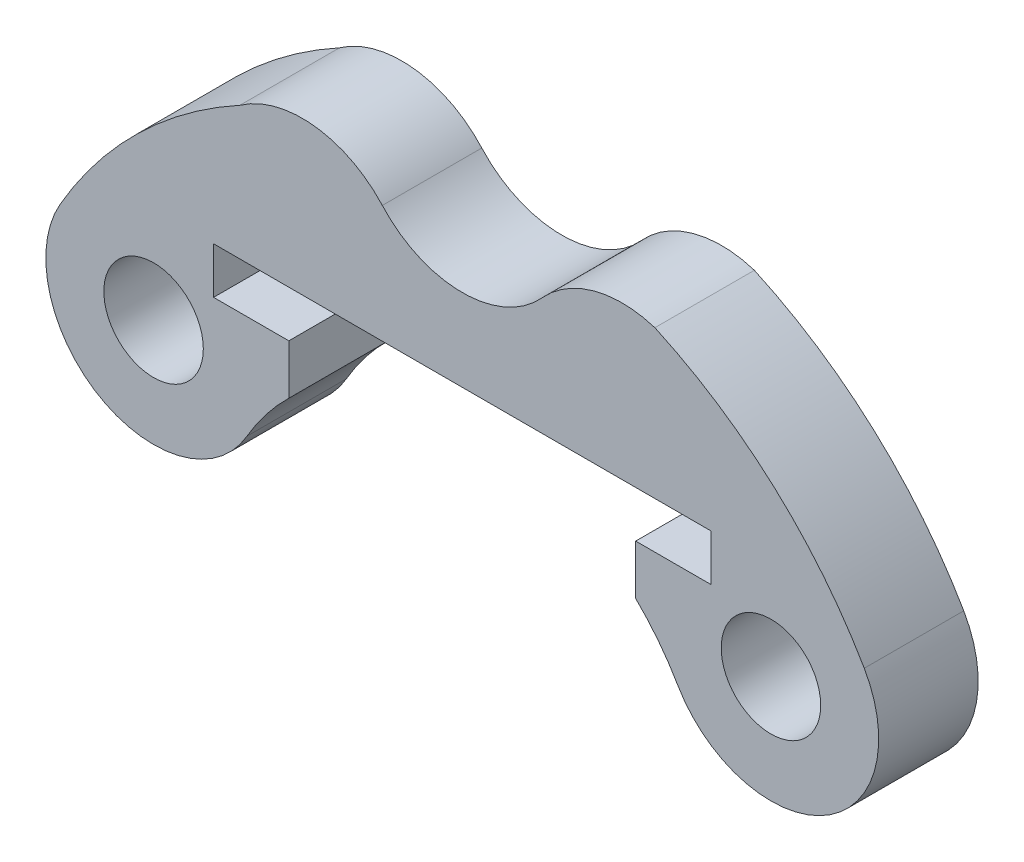
ISO-10303-21;
HEADER;
FILE_DESCRIPTION(('STEP AP214'),'2;1');
FILE_NAME('part.step','',(''),(''),'','','');
FILE_SCHEMA(('AUTOMOTIVE_DESIGN { 1 0 10303 214 1 1 1 1 }'));
ENDSEC;
DATA;
#1=APPLICATION_CONTEXT('core data for automotive mechanical design processes');
#2=APPLICATION_PROTOCOL_DEFINITION('international standard','automotive_design',2000,#1);
#3=PRODUCT_CONTEXT('',#1,'mechanical');
#4=PRODUCT('Part','Part','',(#3));
#5=PRODUCT_RELATED_PRODUCT_CATEGORY('part','',(#4));
#6=PRODUCT_DEFINITION_FORMATION('','',#4);
#7=PRODUCT_DEFINITION_CONTEXT('part definition',#1,'design');
#8=PRODUCT_DEFINITION('design','',#6,#7);
#9=PRODUCT_DEFINITION_SHAPE('','',#8);
#10=(LENGTH_UNIT() NAMED_UNIT(*) SI_UNIT(.MILLI.,.METRE.));
#11=(NAMED_UNIT(*) PLANE_ANGLE_UNIT() SI_UNIT($,.RADIAN.));
#12=(NAMED_UNIT(*) SI_UNIT($,.STERADIAN.) SOLID_ANGLE_UNIT());
#13=UNCERTAINTY_MEASURE_WITH_UNIT(LENGTH_MEASURE(1.E-05),#10,'distance_accuracy_value','');
#14=(GEOMETRIC_REPRESENTATION_CONTEXT(3) GLOBAL_UNCERTAINTY_ASSIGNED_CONTEXT((#13)) GLOBAL_UNIT_ASSIGNED_CONTEXT((#10,
#11,#12)) REPRESENTATION_CONTEXT('',''));
#15=CARTESIAN_POINT('',(0.,0.,0.));
#16=DIRECTION('',(0.,0.,1.));
#17=DIRECTION('',(1.,0.,0.));
#18=AXIS2_PLACEMENT_3D('',#15,#16,#17);
#19=CARTESIAN_POINT('',(-9.30977309068277,5.37499999999991,3.));
#20=DIRECTION('',(0.,0.,1.));
#21=DIRECTION('',(1.,0.,0.));
#22=AXIS2_PLACEMENT_3D('',#19,#20,#21);
#23=PLANE('',#22);
#24=CARTESIAN_POINT('',(9.30977309068406,5.37499999999767,3.));
#25=DIRECTION('',(0.,0.,1.));
#26=DIRECTION('',(1.,0.,0.));
#27=AXIS2_PLACEMENT_3D('',#24,#25,#26);
#28=CIRCLE('',#27,1.49999999999935);
#29=CARTESIAN_POINT('',(10.8097730906834,5.37499999999767,3.));
#30=VERTEX_POINT('',#29);
#31=EDGE_CURVE('E182',#30,#30,#28,.T.);
#32=ORIENTED_EDGE('',*,*,#31,.F.);
#33=EDGE_LOOP('',(#32));
#34=FACE_BOUND('',#33,.T.);
#35=CARTESIAN_POINT('',(-9.30977309068277,5.37499999999991,3.));
#36=DIRECTION('',(0.,0.,1.));
#37=DIRECTION('',(1.,0.,0.));
#38=AXIS2_PLACEMENT_3D('',#35,#36,#37);
#39=CIRCLE('',#38,3.25);
#40=CARTESIAN_POINT('',(-12.1243556529822,6.99999999999988,3.));
#41=VERTEX_POINT('',#40);
#42=CARTESIAN_POINT('',(-6.49519052838333,3.74999999999994,3.));
#43=VERTEX_POINT('',#42);
#44=EDGE_CURVE('E209',#41,#43,#39,.T.);
#45=ORIENTED_EDGE('',*,*,#44,.T.);
#46=CARTESIAN_POINT('',(0.,0.,3.));
#47=DIRECTION('',(0.,0.,-1.));
#48=DIRECTION('',(1.,0.,0.));
#49=AXIS2_PLACEMENT_3D('',#46,#47,#48);
#50=CIRCLE('',#49,7.5);
#51=CARTESIAN_POINT('',(-5.23061898822752,5.37499999999942,3.));
#52=VERTEX_POINT('',#51);
#53=EDGE_CURVE('E117',#43,#52,#50,.T.);
#54=ORIENTED_EDGE('',*,*,#53,.T.);
#55=DIRECTION('',(0.,1.,0.));
#56=VECTOR('',#55,1.);
#57=CARTESIAN_POINT('',(-5.23061898822752,5.37499999999942,3.));
#58=LINE('',#57,#56);
#59=CARTESIAN_POINT('',(-5.23061898822752,6.87499999999702,3.));
#60=VERTEX_POINT('',#59);
#61=EDGE_CURVE('E248',#52,#60,#58,.T.);
#62=ORIENTED_EDGE('',*,*,#61,.T.);
#63=DIRECTION('',(-1.,0.,0.));
#64=VECTOR('',#63,1.);
#65=CARTESIAN_POINT('',(-5.23061898822752,6.87499999999702,3.));
#66=LINE('',#65,#64);
#67=CARTESIAN_POINT('',(-7.49999999999935,6.87499999999702,3.));
#68=VERTEX_POINT('',#67);
#69=EDGE_CURVE('E267',#60,#68,#66,.T.);
#70=ORIENTED_EDGE('',*,*,#69,.T.);
#71=DIRECTION('',(0.,1.,0.));
#72=VECTOR('',#71,1.);
#73=CARTESIAN_POINT('',(-7.49999999999935,8.27499999999702,3.));
#74=LINE('',#73,#72);
#75=CARTESIAN_POINT('',(-7.49999999999935,8.27499999999702,3.));
#76=VERTEX_POINT('',#75);
#77=EDGE_CURVE('E264',#68,#76,#74,.T.);
#78=ORIENTED_EDGE('',*,*,#77,.T.);
#79=DIRECTION('',(1.,0.,0.));
#80=VECTOR('',#79,1.);
#81=CARTESIAN_POINT('',(7.50000000000065,8.27499999999702,3.));
#82=LINE('',#81,#80);
#83=CARTESIAN_POINT('',(7.50000000000065,8.27499999999702,3.));
#84=VERTEX_POINT('',#83);
#85=EDGE_CURVE('E266',#76,#84,#82,.T.);
#86=ORIENTED_EDGE('',*,*,#85,.T.);
#87=DIRECTION('',(0.,-1.,0.));
#88=VECTOR('',#87,1.);
#89=CARTESIAN_POINT('',(7.50000000000065,6.87499999999702,3.));
#90=LINE('',#89,#88);
#91=CARTESIAN_POINT('',(7.50000000000065,6.87499999999702,3.));
#92=VERTEX_POINT('',#91);
#93=EDGE_CURVE('E269',#84,#92,#90,.T.);
#94=ORIENTED_EDGE('',*,*,#93,.T.);
#95=DIRECTION('',(-1.,0.,0.));
#96=VECTOR('',#95,1.);
#97=CARTESIAN_POINT('',(5.23061898822881,6.87499999999702,3.));
#98=LINE('',#97,#96);
#99=CARTESIAN_POINT('',(5.23061898822881,6.87499999999702,3.));
#100=VERTEX_POINT('',#99);
#101=EDGE_CURVE('E275',#92,#100,#98,.T.);
#102=ORIENTED_EDGE('',*,*,#101,.T.);
#103=DIRECTION('',(0.,-1.,0.));
#104=VECTOR('',#103,1.);
#105=CARTESIAN_POINT('',(5.23061898822881,5.37499999999816,3.));
#106=LINE('',#105,#104);
#107=CARTESIAN_POINT('',(5.23061898822881,5.37499999999816,3.));
#108=VERTEX_POINT('',#107);
#109=EDGE_CURVE('E277',#100,#108,#106,.T.);
#110=ORIENTED_EDGE('',*,*,#109,.T.);
#111=CARTESIAN_POINT('',(0.,0.,3.));
#112=DIRECTION('',(0.,0.,-1.));
#113=DIRECTION('',(1.,0.,0.));
#114=AXIS2_PLACEMENT_3D('',#111,#112,#113);
#115=CIRCLE('',#114,7.5);
#116=CARTESIAN_POINT('',(6.49519052838322,3.75000000000012,3.));
#117=VERTEX_POINT('',#116);
#118=EDGE_CURVE('E279',#108,#117,#115,.T.);
#119=ORIENTED_EDGE('',*,*,#118,.T.);
#120=CARTESIAN_POINT('',(9.30977309068406,5.37499999999767,3.));
#121=DIRECTION('',(0.,0.,1.));
#122=DIRECTION('',(1.,0.,0.));
#123=AXIS2_PLACEMENT_3D('',#120,#121,#122);
#124=CIRCLE('',#123,3.25);
#125=CARTESIAN_POINT('',(12.1243556529839,6.99999999999697,3.));
#126=VERTEX_POINT('',#125);
#127=EDGE_CURVE('E281',#117,#126,#124,.T.);
#128=ORIENTED_EDGE('',*,*,#127,.T.);
#129=CARTESIAN_POINT('',(0.,0.,3.));
#130=DIRECTION('',(0.,0.,1.));
#131=DIRECTION('',(1.,0.,0.));
#132=AXIS2_PLACEMENT_3D('',#129,#130,#131);
#133=CIRCLE('',#132,14.);
#134=CARTESIAN_POINT('',(5.80943087987062,12.7377593340432,3.));
#135=VERTEX_POINT('',#134);
#136=EDGE_CURVE('E283',#126,#135,#133,.T.);
#137=ORIENTED_EDGE('',*,*,#136,.T.);
#138=CARTESIAN_POINT('',(4.82206978136234,9.64137142857136,3.));
#139=DIRECTION('',(0.,0.,1.));
#140=DIRECTION('',(1.,0.,0.));
#141=AXIS2_PLACEMENT_3D('',#138,#139,#140);
#142=CIRCLE('',#141,3.25);
#143=CARTESIAN_POINT('',(2.41103489067909,11.8206857142833,3.));
#144=VERTEX_POINT('',#143);
#145=EDGE_CURVE('E160',#135,#144,#142,.T.);
#146=ORIENTED_EDGE('',*,*,#145,.T.);
#147=CARTESIAN_POINT('',(1.07437023516552E-11,13.9999999999817,3.));
#148=DIRECTION('',(0.,0.,-1.));
#149=DIRECTION('',(1.,0.,0.));
#150=AXIS2_PLACEMENT_3D('',#147,#148,#149);
#151=CIRCLE('',#150,3.24999999997992);
#152=CARTESIAN_POINT('',(-2.41103489066096,11.820685714287,3.));
#153=VERTEX_POINT('',#152);
#154=EDGE_CURVE('E154',#144,#153,#151,.T.);
#155=ORIENTED_EDGE('',*,*,#154,.T.);
#156=CARTESIAN_POINT('',(-4.82206978134755,9.64137142857876,3.));
#157=DIRECTION('',(0.,0.,1.));
#158=DIRECTION('',(1.,0.,0.));
#159=AXIS2_PLACEMENT_3D('',#156,#157,#158);
#160=CIRCLE('',#159,3.25);
#161=CARTESIAN_POINT('',(-6.70737151186402,12.2886601141799,3.));
#162=VERTEX_POINT('',#161);
#163=EDGE_CURVE('E158',#153,#162,#160,.T.);
#164=ORIENTED_EDGE('',*,*,#163,.T.);
#165=CARTESIAN_POINT('',(0.,0.,3.));
#166=DIRECTION('',(0.,0.,1.));
#167=DIRECTION('',(1.,0.,0.));
#168=AXIS2_PLACEMENT_3D('',#165,#166,#167);
#169=CIRCLE('',#168,14.);
#170=EDGE_CURVE('E50',#162,#41,#169,.T.);
#171=ORIENTED_EDGE('',*,*,#170,.T.);
#172=EDGE_LOOP('',(#45,#54,#62,#70,#78,#86,#94,#102,#110,#119,#128,#137,#146,#155,#164,#171));
#173=FACE_BOUND('',#172,.T.);
#174=CARTESIAN_POINT('',(-9.30977309068277,5.37499999999991,3.));
#175=DIRECTION('',(0.,0.,1.));
#176=DIRECTION('',(1.,0.,0.));
#177=AXIS2_PLACEMENT_3D('',#174,#175,#176);
#178=CIRCLE('',#177,1.5);
#179=CARTESIAN_POINT('',(-7.80977309068277,5.37499999999991,3.));
#180=VERTEX_POINT('',#179);
#181=EDGE_CURVE('E325',#180,#180,#178,.T.);
#182=ORIENTED_EDGE('',*,*,#181,.F.);
#183=EDGE_LOOP('',(#182));
#184=FACE_BOUND('',#183,.T.);
#185=ADVANCED_FACE('F33',(#34,#173,#184),#23,.T.);
#186=CARTESIAN_POINT('',(-9.30977309068277,5.37499999999991,0.));
#187=DIRECTION('',(0.,0.,1.));
#188=DIRECTION('',(1.,0.,0.));
#189=AXIS2_PLACEMENT_3D('',#186,#187,#188);
#190=PLANE('',#189);
#191=CARTESIAN_POINT('',(-9.30977309068277,5.37499999999991,0.));
#192=DIRECTION('',(0.,0.,1.));
#193=DIRECTION('',(1.,0.,0.));
#194=AXIS2_PLACEMENT_3D('',#191,#192,#193);
#195=CIRCLE('',#194,3.25);
#196=CARTESIAN_POINT('',(-12.1243556529822,6.99999999999988,0.));
#197=VERTEX_POINT('',#196);
#198=CARTESIAN_POINT('',(-6.49519052838333,3.74999999999994,0.));
#199=VERTEX_POINT('',#198);
#200=EDGE_CURVE('E178',#197,#199,#195,.T.);
#201=ORIENTED_EDGE('',*,*,#200,.F.);
#202=CARTESIAN_POINT('',(0.,0.,0.));
#203=DIRECTION('',(0.,0.,1.));
#204=DIRECTION('',(1.,0.,0.));
#205=AXIS2_PLACEMENT_3D('',#202,#203,#204);
#206=CIRCLE('',#205,14.);
#207=CARTESIAN_POINT('',(-6.70737151186402,12.2886601141799,0.));
#208=VERTEX_POINT('',#207);
#209=EDGE_CURVE('E109',#208,#197,#206,.T.);
#210=ORIENTED_EDGE('',*,*,#209,.F.);
#211=CARTESIAN_POINT('',(-4.82206978134755,9.64137142857876,0.));
#212=DIRECTION('',(0.,0.,1.));
#213=DIRECTION('',(1.,0.,0.));
#214=AXIS2_PLACEMENT_3D('',#211,#212,#213);
#215=CIRCLE('',#214,3.25);
#216=CARTESIAN_POINT('',(-2.41103489066096,11.820685714287,0.));
#217=VERTEX_POINT('',#216);
#218=EDGE_CURVE('E103',#217,#208,#215,.T.);
#219=ORIENTED_EDGE('',*,*,#218,.F.);
#220=CARTESIAN_POINT('',(1.07437023516552E-11,13.9999999999817,0.));
#221=DIRECTION('',(0.,0.,-1.));
#222=DIRECTION('',(1.,0.,0.));
#223=AXIS2_PLACEMENT_3D('',#220,#221,#222);
#224=CIRCLE('',#223,3.24999999997992);
#225=CARTESIAN_POINT('',(2.41103489067909,11.8206857142833,0.));
#226=VERTEX_POINT('',#225);
#227=EDGE_CURVE('E168',#226,#217,#224,.T.);
#228=ORIENTED_EDGE('',*,*,#227,.F.);
#229=CARTESIAN_POINT('',(4.82206978136234,9.64137142857136,0.));
#230=DIRECTION('',(0.,0.,1.));
#231=DIRECTION('',(1.,0.,0.));
#232=AXIS2_PLACEMENT_3D('',#229,#230,#231);
#233=CIRCLE('',#232,3.25);
#234=CARTESIAN_POINT('',(5.80943087987062,12.7377593340432,0.));
#235=VERTEX_POINT('',#234);
#236=EDGE_CURVE('E204',#235,#226,#233,.T.);
#237=ORIENTED_EDGE('',*,*,#236,.F.);
#238=CARTESIAN_POINT('',(0.,0.,0.));
#239=DIRECTION('',(0.,0.,1.));
#240=DIRECTION('',(1.,0.,0.));
#241=AXIS2_PLACEMENT_3D('',#238,#239,#240);
#242=CIRCLE('',#241,14.);
#243=CARTESIAN_POINT('',(12.1243556529839,6.99999999999697,0.));
#244=VERTEX_POINT('',#243);
#245=EDGE_CURVE('E202',#244,#235,#242,.T.);
#246=ORIENTED_EDGE('',*,*,#245,.F.);
#247=CARTESIAN_POINT('',(9.30977309068406,5.37499999999767,0.));
#248=DIRECTION('',(0.,0.,1.));
#249=DIRECTION('',(1.,0.,0.));
#250=AXIS2_PLACEMENT_3D('',#247,#248,#249);
#251=CIRCLE('',#250,3.25);
#252=CARTESIAN_POINT('',(6.49519052838322,3.75000000000012,0.));
#253=VERTEX_POINT('',#252);
#254=EDGE_CURVE('E200',#253,#244,#251,.T.);
#255=ORIENTED_EDGE('',*,*,#254,.F.);
#256=CARTESIAN_POINT('',(0.,0.,0.));
#257=DIRECTION('',(0.,0.,-1.));
#258=DIRECTION('',(1.,0.,0.));
#259=AXIS2_PLACEMENT_3D('',#256,#257,#258);
#260=CIRCLE('',#259,7.5);
#261=CARTESIAN_POINT('',(5.23061898822881,5.37499999999816,0.));
#262=VERTEX_POINT('',#261);
#263=EDGE_CURVE('E198',#262,#253,#260,.T.);
#264=ORIENTED_EDGE('',*,*,#263,.F.);
#265=DIRECTION('',(0.,-1.,0.));
#266=VECTOR('',#265,1.);
#267=CARTESIAN_POINT('',(5.23061898822881,5.37499999999816,0.));
#268=LINE('',#267,#266);
#269=CARTESIAN_POINT('',(5.23061898822881,6.87499999999702,0.));
#270=VERTEX_POINT('',#269);
#271=EDGE_CURVE('E196',#270,#262,#268,.T.);
#272=ORIENTED_EDGE('',*,*,#271,.F.);
#273=DIRECTION('',(-1.,0.,0.));
#274=VECTOR('',#273,1.);
#275=CARTESIAN_POINT('',(5.23061898822881,6.87499999999702,0.));
#276=LINE('',#275,#274);
#277=CARTESIAN_POINT('',(7.50000000000065,6.87499999999702,0.));
#278=VERTEX_POINT('',#277);
#279=EDGE_CURVE('E194',#278,#270,#276,.T.);
#280=ORIENTED_EDGE('',*,*,#279,.F.);
#281=DIRECTION('',(0.,-1.,0.));
#282=VECTOR('',#281,1.);
#283=CARTESIAN_POINT('',(7.50000000000065,6.87499999999702,0.));
#284=LINE('',#283,#282);
#285=CARTESIAN_POINT('',(7.50000000000065,8.27499999999702,0.));
#286=VERTEX_POINT('',#285);
#287=EDGE_CURVE('E192',#286,#278,#284,.T.);
#288=ORIENTED_EDGE('',*,*,#287,.F.);
#289=DIRECTION('',(1.,0.,0.));
#290=VECTOR('',#289,1.);
#291=CARTESIAN_POINT('',(7.50000000000065,8.27499999999702,0.));
#292=LINE('',#291,#290);
#293=CARTESIAN_POINT('',(-7.49999999999935,8.27499999999702,0.));
#294=VERTEX_POINT('',#293);
#295=EDGE_CURVE('E190',#294,#286,#292,.T.);
#296=ORIENTED_EDGE('',*,*,#295,.F.);
#297=DIRECTION('',(0.,1.,0.));
#298=VECTOR('',#297,1.);
#299=CARTESIAN_POINT('',(-7.49999999999935,8.27499999999702,0.));
#300=LINE('',#299,#298);
#301=CARTESIAN_POINT('',(-7.49999999999935,6.87499999999702,0.));
#302=VERTEX_POINT('',#301);
#303=EDGE_CURVE('E188',#302,#294,#300,.T.);
#304=ORIENTED_EDGE('',*,*,#303,.F.);
#305=DIRECTION('',(-1.,0.,0.));
#306=VECTOR('',#305,1.);
#307=CARTESIAN_POINT('',(-5.23061898822752,6.87499999999702,0.));
#308=LINE('',#307,#306);
#309=CARTESIAN_POINT('',(-5.23061898822752,6.87499999999702,0.));
#310=VERTEX_POINT('',#309);
#311=EDGE_CURVE('E186',#310,#302,#308,.T.);
#312=ORIENTED_EDGE('',*,*,#311,.F.);
#313=DIRECTION('',(0.,1.,0.));
#314=VECTOR('',#313,1.);
#315=CARTESIAN_POINT('',(-5.23061898822752,5.37499999999942,0.));
#316=LINE('',#315,#314);
#317=CARTESIAN_POINT('',(-5.23061898822752,5.37499999999942,0.));
#318=VERTEX_POINT('',#317);
#319=EDGE_CURVE('E184',#318,#310,#316,.T.);
#320=ORIENTED_EDGE('',*,*,#319,.F.);
#321=CARTESIAN_POINT('',(0.,0.,0.));
#322=DIRECTION('',(0.,0.,-1.));
#323=DIRECTION('',(1.,0.,0.));
#324=AXIS2_PLACEMENT_3D('',#321,#322,#323);
#325=CIRCLE('',#324,7.5);
#326=EDGE_CURVE('E181',#199,#318,#325,.T.);
#327=ORIENTED_EDGE('',*,*,#326,.F.);
#328=EDGE_LOOP('',(#201,#210,#219,#228,#237,#246,#255,#264,#272,#280,#288,#296,#304,#312,#320,#327));
#329=FACE_BOUND('',#328,.T.);
#330=CARTESIAN_POINT('',(9.30977309068406,5.37499999999767,0.));
#331=DIRECTION('',(0.,0.,1.));
#332=DIRECTION('',(1.,0.,0.));
#333=AXIS2_PLACEMENT_3D('',#330,#331,#332);
#334=CIRCLE('',#333,1.49999999999935);
#335=CARTESIAN_POINT('',(10.8097730906834,5.37499999999767,0.));
#336=VERTEX_POINT('',#335);
#337=EDGE_CURVE('E331',#336,#336,#334,.T.);
#338=ORIENTED_EDGE('',*,*,#337,.T.);
#339=EDGE_LOOP('',(#338));
#340=FACE_BOUND('',#339,.T.);
#341=CARTESIAN_POINT('',(-9.30977309068277,5.37499999999991,0.));
#342=DIRECTION('',(0.,0.,1.));
#343=DIRECTION('',(1.,0.,0.));
#344=AXIS2_PLACEMENT_3D('',#341,#342,#343);
#345=CIRCLE('',#344,1.5);
#346=CARTESIAN_POINT('',(-7.80977309068277,5.37499999999991,0.));
#347=VERTEX_POINT('',#346);
#348=EDGE_CURVE('E328',#347,#347,#345,.T.);
#349=ORIENTED_EDGE('',*,*,#348,.T.);
#350=EDGE_LOOP('',(#349));
#351=FACE_BOUND('',#350,.T.);
#352=ADVANCED_FACE('F252',(#329,#340,#351),#190,.F.);
#353=CARTESIAN_POINT('',(-9.30977309068277,5.37499999999991,3.));
#354=DIRECTION('',(0.,0.,-1.));
#355=DIRECTION('',(-1.,0.,0.));
#356=AXIS2_PLACEMENT_3D('',#353,#354,#355);
#357=CYLINDRICAL_SURFACE('',#356,3.25);
#358=ORIENTED_EDGE('',*,*,#200,.T.);
#359=DIRECTION('',(0.,0.,-1.));
#360=VECTOR('',#359,1.);
#361=CARTESIAN_POINT('',(-6.49519052838333,3.74999999999994,3.));
#362=LINE('',#361,#360);
#363=EDGE_CURVE('E11',#43,#199,#362,.T.);
#364=ORIENTED_EDGE('',*,*,#363,.F.);
#365=ORIENTED_EDGE('',*,*,#44,.F.);
#366=DIRECTION('',(0.,0.,-1.));
#367=VECTOR('',#366,1.);
#368=CARTESIAN_POINT('',(-12.1243556529822,6.99999999999988,3.));
#369=LINE('',#368,#367);
#370=EDGE_CURVE('E174',#41,#197,#369,.T.);
#371=ORIENTED_EDGE('',*,*,#370,.T.);
#372=EDGE_LOOP('',(#358,#364,#365,#371));
#373=FACE_BOUND('',#372,.T.);
#374=ADVANCED_FACE('F35',(#373),#357,.T.);
#375=CARTESIAN_POINT('',(0.,0.,3.));
#376=DIRECTION('',(0.,0.,-1.));
#377=DIRECTION('',(-1.,0.,0.));
#378=AXIS2_PLACEMENT_3D('',#375,#376,#377);
#379=CYLINDRICAL_SURFACE('',#378,7.5);
#380=ORIENTED_EDGE('',*,*,#326,.T.);
#381=DIRECTION('',(0.,0.,-1.));
#382=VECTOR('',#381,1.);
#383=CARTESIAN_POINT('',(-5.23061898822752,5.37499999999942,3.));
#384=LINE('',#383,#382);
#385=EDGE_CURVE('E42',#52,#318,#384,.T.);
#386=ORIENTED_EDGE('',*,*,#385,.F.);
#387=ORIENTED_EDGE('',*,*,#53,.F.);
#388=ORIENTED_EDGE('',*,*,#363,.T.);
#389=EDGE_LOOP('',(#380,#386,#387,#388));
#390=FACE_BOUND('',#389,.T.);
#391=ADVANCED_FACE('F464',(#390),#379,.F.);
#392=CARTESIAN_POINT('',(-5.23061898822752,5.37499999999942,3.));
#393=DIRECTION('',(-1.,0.,0.));
#394=DIRECTION('',(0.,-1.,0.));
#395=AXIS2_PLACEMENT_3D('',#392,#393,#394);
#396=PLANE('',#395);
#397=ORIENTED_EDGE('',*,*,#319,.T.);
#398=DIRECTION('',(0.,0.,-1.));
#399=VECTOR('',#398,1.);
#400=CARTESIAN_POINT('',(-5.23061898822752,6.87499999999702,3.));
#401=LINE('',#400,#399);
#402=EDGE_CURVE('E240',#60,#310,#401,.T.);
#403=ORIENTED_EDGE('',*,*,#402,.F.);
#404=ORIENTED_EDGE('',*,*,#61,.F.);
#405=ORIENTED_EDGE('',*,*,#385,.T.);
#406=EDGE_LOOP('',(#397,#403,#404,#405));
#407=FACE_BOUND('',#406,.T.);
#408=ADVANCED_FACE('F246',(#407),#396,.F.);
#409=CARTESIAN_POINT('',(-5.23061898822752,6.87499999999702,3.));
#410=DIRECTION('',(0.,-1.,0.));
#411=DIRECTION('',(1.,0.,0.));
#412=AXIS2_PLACEMENT_3D('',#409,#410,#411);
#413=PLANE('',#412);
#414=ORIENTED_EDGE('',*,*,#311,.T.);
#415=DIRECTION('',(0.,0.,-1.));
#416=VECTOR('',#415,1.);
#417=CARTESIAN_POINT('',(-7.49999999999935,6.87499999999702,3.));
#418=LINE('',#417,#416);
#419=EDGE_CURVE('E237',#68,#302,#418,.T.);
#420=ORIENTED_EDGE('',*,*,#419,.F.);
#421=ORIENTED_EDGE('',*,*,#69,.F.);
#422=ORIENTED_EDGE('',*,*,#402,.T.);
#423=EDGE_LOOP('',(#414,#420,#421,#422));
#424=FACE_BOUND('',#423,.T.);
#425=ADVANCED_FACE('F258',(#424),#413,.F.);
#426=CARTESIAN_POINT('',(-7.49999999999935,8.27499999999702,3.));
#427=DIRECTION('',(-1.,0.,0.));
#428=DIRECTION('',(0.,0.,1.));
#429=AXIS2_PLACEMENT_3D('',#426,#427,#428);
#430=PLANE('',#429);
#431=ORIENTED_EDGE('',*,*,#303,.T.);
#432=DIRECTION('',(0.,0.,-1.));
#433=VECTOR('',#432,1.);
#434=CARTESIAN_POINT('',(-7.49999999999935,8.27499999999702,3.));
#435=LINE('',#434,#433);
#436=EDGE_CURVE('E234',#76,#294,#435,.T.);
#437=ORIENTED_EDGE('',*,*,#436,.F.);
#438=ORIENTED_EDGE('',*,*,#77,.F.);
#439=ORIENTED_EDGE('',*,*,#419,.T.);
#440=EDGE_LOOP('',(#431,#437,#438,#439));
#441=FACE_BOUND('',#440,.T.);
#442=ADVANCED_FACE('F262',(#441),#430,.F.);
#443=CARTESIAN_POINT('',(7.50000000000065,8.27499999999702,3.));
#444=DIRECTION('',(0.,1.,0.));
#445=DIRECTION('',(-1.,0.,0.));
#446=AXIS2_PLACEMENT_3D('',#443,#444,#445);
#447=PLANE('',#446);
#448=ORIENTED_EDGE('',*,*,#295,.T.);
#449=DIRECTION('',(0.,0.,-1.));
#450=VECTOR('',#449,1.);
#451=CARTESIAN_POINT('',(7.50000000000065,8.27499999999702,3.));
#452=LINE('',#451,#450);
#453=EDGE_CURVE('E231',#84,#286,#452,.T.);
#454=ORIENTED_EDGE('',*,*,#453,.F.);
#455=ORIENTED_EDGE('',*,*,#85,.F.);
#456=ORIENTED_EDGE('',*,*,#436,.T.);
#457=EDGE_LOOP('',(#448,#454,#455,#456));
#458=FACE_BOUND('',#457,.T.);
#459=ADVANCED_FACE('F429',(#458),#447,.F.);
#460=CARTESIAN_POINT('',(7.50000000000065,6.87499999999702,3.));
#461=DIRECTION('',(1.,0.,0.));
#462=DIRECTION('',(0.,0.,-1.));
#463=AXIS2_PLACEMENT_3D('',#460,#461,#462);
#464=PLANE('',#463);
#465=ORIENTED_EDGE('',*,*,#287,.T.);
#466=DIRECTION('',(0.,0.,-1.));
#467=VECTOR('',#466,1.);
#468=CARTESIAN_POINT('',(7.50000000000065,6.87499999999702,3.));
#469=LINE('',#468,#467);
#470=EDGE_CURVE('E228',#92,#278,#469,.T.);
#471=ORIENTED_EDGE('',*,*,#470,.F.);
#472=ORIENTED_EDGE('',*,*,#93,.F.);
#473=ORIENTED_EDGE('',*,*,#453,.T.);
#474=EDGE_LOOP('',(#465,#471,#472,#473));
#475=FACE_BOUND('',#474,.T.);
#476=ADVANCED_FACE('F419',(#475),#464,.F.);
#477=CARTESIAN_POINT('',(5.23061898822881,6.87499999999702,3.));
#478=DIRECTION('',(0.,-1.,0.));
#479=DIRECTION('',(1.,0.,0.));
#480=AXIS2_PLACEMENT_3D('',#477,#478,#479);
#481=PLANE('',#480);
#482=ORIENTED_EDGE('',*,*,#279,.T.);
#483=DIRECTION('',(0.,0.,-1.));
#484=VECTOR('',#483,1.);
#485=CARTESIAN_POINT('',(5.23061898822881,6.87499999999702,3.));
#486=LINE('',#485,#484);
#487=EDGE_CURVE('E225',#100,#270,#486,.T.);
#488=ORIENTED_EDGE('',*,*,#487,.F.);
#489=ORIENTED_EDGE('',*,*,#101,.F.);
#490=ORIENTED_EDGE('',*,*,#470,.T.);
#491=EDGE_LOOP('',(#482,#488,#489,#490));
#492=FACE_BOUND('',#491,.T.);
#493=ADVANCED_FACE('F409',(#492),#481,.F.);
#494=CARTESIAN_POINT('',(5.23061898822881,5.37499999999816,3.));
#495=DIRECTION('',(1.,0.,0.));
#496=DIRECTION('',(0.,1.,0.));
#497=AXIS2_PLACEMENT_3D('',#494,#495,#496);
#498=PLANE('',#497);
#499=ORIENTED_EDGE('',*,*,#271,.T.);
#500=DIRECTION('',(0.,0.,-1.));
#501=VECTOR('',#500,1.);
#502=CARTESIAN_POINT('',(5.23061898822881,5.37499999999816,3.));
#503=LINE('',#502,#501);
#504=EDGE_CURVE('E222',#108,#262,#503,.T.);
#505=ORIENTED_EDGE('',*,*,#504,.F.);
#506=ORIENTED_EDGE('',*,*,#109,.F.);
#507=ORIENTED_EDGE('',*,*,#487,.T.);
#508=EDGE_LOOP('',(#499,#505,#506,#507));
#509=FACE_BOUND('',#508,.T.);
#510=ADVANCED_FACE('F399',(#509),#498,.F.);
#511=CARTESIAN_POINT('',(0.,0.,3.));
#512=DIRECTION('',(0.,0.,-1.));
#513=DIRECTION('',(-1.,0.,0.));
#514=AXIS2_PLACEMENT_3D('',#511,#512,#513);
#515=CYLINDRICAL_SURFACE('',#514,7.5);
#516=ORIENTED_EDGE('',*,*,#263,.T.);
#517=DIRECTION('',(0.,0.,-1.));
#518=VECTOR('',#517,1.);
#519=CARTESIAN_POINT('',(6.49519052838322,3.75000000000012,3.));
#520=LINE('',#519,#518);
#521=EDGE_CURVE('E219',#117,#253,#520,.T.);
#522=ORIENTED_EDGE('',*,*,#521,.F.);
#523=ORIENTED_EDGE('',*,*,#118,.F.);
#524=ORIENTED_EDGE('',*,*,#504,.T.);
#525=EDGE_LOOP('',(#516,#522,#523,#524));
#526=FACE_BOUND('',#525,.T.);
#527=ADVANCED_FACE('F389',(#526),#515,.F.);
#528=CARTESIAN_POINT('',(9.30977309068406,5.37499999999767,3.));
#529=DIRECTION('',(0.,0.,-1.));
#530=DIRECTION('',(-1.,0.,0.));
#531=AXIS2_PLACEMENT_3D('',#528,#529,#530);
#532=CYLINDRICAL_SURFACE('',#531,3.25);
#533=ORIENTED_EDGE('',*,*,#254,.T.);
#534=DIRECTION('',(0.,0.,-1.));
#535=VECTOR('',#534,1.);
#536=CARTESIAN_POINT('',(12.1243556529839,6.99999999999697,3.));
#537=LINE('',#536,#535);
#538=EDGE_CURVE('E216',#126,#244,#537,.T.);
#539=ORIENTED_EDGE('',*,*,#538,.F.);
#540=ORIENTED_EDGE('',*,*,#127,.F.);
#541=ORIENTED_EDGE('',*,*,#521,.T.);
#542=EDGE_LOOP('',(#533,#539,#540,#541));
#543=FACE_BOUND('',#542,.T.);
#544=ADVANCED_FACE('F380',(#543),#532,.T.);
#545=CARTESIAN_POINT('',(0.,0.,3.));
#546=DIRECTION('',(0.,0.,-1.));
#547=DIRECTION('',(-1.,0.,0.));
#548=AXIS2_PLACEMENT_3D('',#545,#546,#547);
#549=CYLINDRICAL_SURFACE('',#548,14.);
#550=ORIENTED_EDGE('',*,*,#245,.T.);
#551=DIRECTION('',(0.,0.,-1.));
#552=VECTOR('',#551,1.);
#553=CARTESIAN_POINT('',(5.80943087987062,12.7377593340432,3.));
#554=LINE('',#553,#552);
#555=EDGE_CURVE('E213',#135,#235,#554,.T.);
#556=ORIENTED_EDGE('',*,*,#555,.F.);
#557=ORIENTED_EDGE('',*,*,#136,.F.);
#558=ORIENTED_EDGE('',*,*,#538,.T.);
#559=EDGE_LOOP('',(#550,#556,#557,#558));
#560=FACE_BOUND('',#559,.T.);
#561=ADVANCED_FACE('F289',(#560),#549,.T.);
#562=CARTESIAN_POINT('',(4.82206978136234,9.64137142857136,3.));
#563=DIRECTION('',(0.,0.,-1.));
#564=DIRECTION('',(-1.,0.,0.));
#565=AXIS2_PLACEMENT_3D('',#562,#563,#564);
#566=CYLINDRICAL_SURFACE('',#565,3.25);
#567=ORIENTED_EDGE('',*,*,#236,.T.);
#568=DIRECTION('',(0.,0.,-1.));
#569=VECTOR('',#568,1.);
#570=CARTESIAN_POINT('',(2.41103489067909,11.8206857142833,3.));
#571=LINE('',#570,#569);
#572=EDGE_CURVE('E169',#144,#226,#571,.T.);
#573=ORIENTED_EDGE('',*,*,#572,.F.);
#574=ORIENTED_EDGE('',*,*,#145,.F.);
#575=ORIENTED_EDGE('',*,*,#555,.T.);
#576=EDGE_LOOP('',(#567,#573,#574,#575));
#577=FACE_BOUND('',#576,.T.);
#578=ADVANCED_FACE('F293',(#577),#566,.T.);
#579=CARTESIAN_POINT('',(1.07437023516552E-11,13.9999999999817,3.));
#580=DIRECTION('',(0.,0.,-1.));
#581=DIRECTION('',(-1.,0.,0.));
#582=AXIS2_PLACEMENT_3D('',#579,#580,#581);
#583=CYLINDRICAL_SURFACE('',#582,3.24999999997992);
#584=ORIENTED_EDGE('',*,*,#227,.T.);
#585=DIRECTION('',(0.,0.,-1.));
#586=VECTOR('',#585,1.);
#587=CARTESIAN_POINT('',(-2.41103489066096,11.820685714287,3.));
#588=LINE('',#587,#586);
#589=EDGE_CURVE('E165',#153,#217,#588,.T.);
#590=ORIENTED_EDGE('',*,*,#589,.F.);
#591=ORIENTED_EDGE('',*,*,#154,.F.);
#592=ORIENTED_EDGE('',*,*,#572,.T.);
#593=EDGE_LOOP('',(#584,#590,#591,#592));
#594=FACE_BOUND('',#593,.T.);
#595=ADVANCED_FACE('F166',(#594),#583,.F.);
#596=CARTESIAN_POINT('',(-4.82206978134755,9.64137142857876,3.));
#597=DIRECTION('',(0.,0.,-1.));
#598=DIRECTION('',(-1.,0.,0.));
#599=AXIS2_PLACEMENT_3D('',#596,#597,#598);
#600=CYLINDRICAL_SURFACE('',#599,3.25);
#601=ORIENTED_EDGE('',*,*,#218,.T.);
#602=DIRECTION('',(0.,0.,-1.));
#603=VECTOR('',#602,1.);
#604=CARTESIAN_POINT('',(-6.70737151186402,12.2886601141799,3.));
#605=LINE('',#604,#603);
#606=EDGE_CURVE('E170',#162,#208,#605,.T.);
#607=ORIENTED_EDGE('',*,*,#606,.F.);
#608=ORIENTED_EDGE('',*,*,#163,.F.);
#609=ORIENTED_EDGE('',*,*,#589,.T.);
#610=EDGE_LOOP('',(#601,#607,#608,#609));
#611=FACE_BOUND('',#610,.T.);
#612=ADVANCED_FACE('F172',(#611),#600,.T.);
#613=CARTESIAN_POINT('',(0.,0.,3.));
#614=DIRECTION('',(0.,0.,-1.));
#615=DIRECTION('',(-1.,0.,0.));
#616=AXIS2_PLACEMENT_3D('',#613,#614,#615);
#617=CYLINDRICAL_SURFACE('',#616,14.);
#618=ORIENTED_EDGE('',*,*,#209,.T.);
#619=ORIENTED_EDGE('',*,*,#370,.F.);
#620=ORIENTED_EDGE('',*,*,#170,.F.);
#621=ORIENTED_EDGE('',*,*,#606,.T.);
#622=EDGE_LOOP('',(#618,#619,#620,#621));
#623=FACE_BOUND('',#622,.T.);
#624=ADVANCED_FACE('F297',(#623),#617,.T.);
#625=CARTESIAN_POINT('',(9.30977309068406,5.37499999999767,3.));
#626=DIRECTION('',(0.,0.,-1.));
#627=DIRECTION('',(-1.,0.,0.));
#628=AXIS2_PLACEMENT_3D('',#625,#626,#627);
#629=CYLINDRICAL_SURFACE('',#628,1.49999999999935);
#630=ORIENTED_EDGE('',*,*,#31,.T.);
#631=EDGE_LOOP('',(#630));
#632=FACE_BOUND('',#631,.T.);
#633=ORIENTED_EDGE('',*,*,#337,.F.);
#634=EDGE_LOOP('',(#633));
#635=FACE_BOUND('',#634,.T.);
#636=ADVANCED_FACE('F299',(#632,#635),#629,.F.);
#637=CARTESIAN_POINT('',(-9.30977309068277,5.37499999999991,3.));
#638=DIRECTION('',(0.,0.,-1.));
#639=DIRECTION('',(-1.,0.,0.));
#640=AXIS2_PLACEMENT_3D('',#637,#638,#639);
#641=CYLINDRICAL_SURFACE('',#640,1.5);
#642=ORIENTED_EDGE('',*,*,#181,.T.);
#643=EDGE_LOOP('',(#642));
#644=FACE_BOUND('',#643,.T.);
#645=ORIENTED_EDGE('',*,*,#348,.F.);
#646=EDGE_LOOP('',(#645));
#647=FACE_BOUND('',#646,.T.);
#648=ADVANCED_FACE('F305',(#644,#647),#641,.F.);
#649=CLOSED_SHELL('',(#185,#352,#374,#391,#408,#425,#442,#459,#476,#493,#510,#527,#544,#561,
#578,#595,#612,#624,#636,#648));
#650=MANIFOLD_SOLID_BREP('B2',#649);
#651=ADVANCED_BREP_SHAPE_REPRESENTATION('',(#18,#650),#14);
#652=SHAPE_DEFINITION_REPRESENTATION(#9,#651);
ENDSEC;
END-ISO-10303-21;
